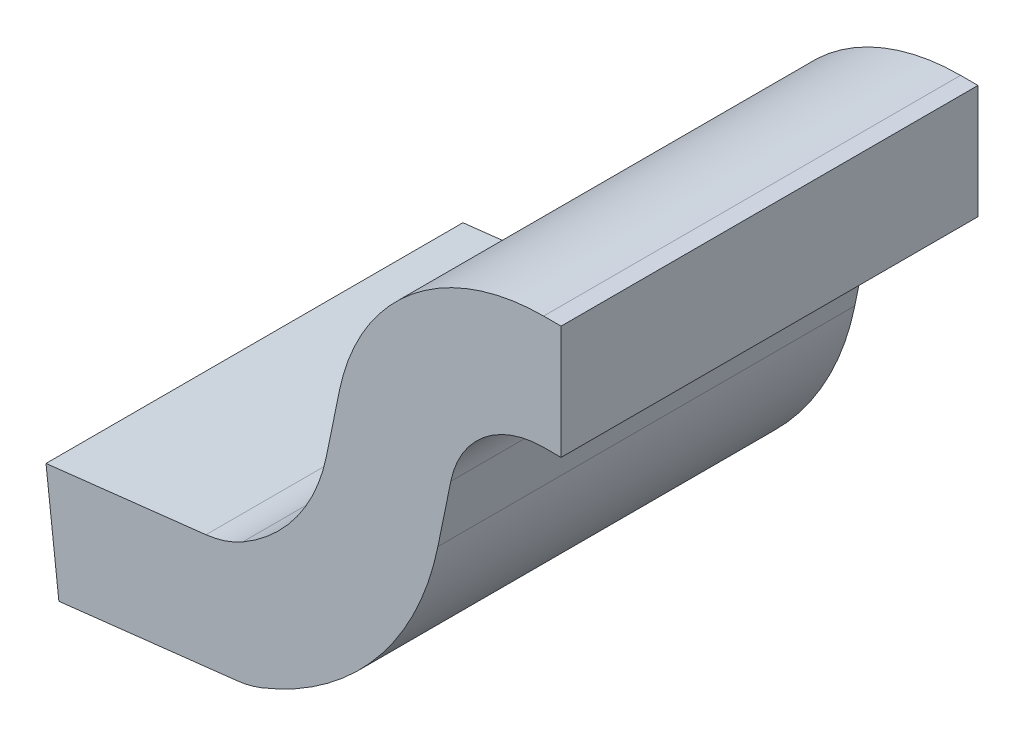
ISO-10303-21;
HEADER;
FILE_DESCRIPTION(('STEP AP214'),'2;1');
FILE_NAME('part.step','',(''),(''),'','','');
FILE_SCHEMA(('AUTOMOTIVE_DESIGN { 1 0 10303 214 1 1 1 1 }'));
ENDSEC;
DATA;
#1=APPLICATION_CONTEXT('core data for automotive mechanical design processes');
#2=APPLICATION_PROTOCOL_DEFINITION('international standard','automotive_design',2000,#1);
#3=PRODUCT_CONTEXT('',#1,'mechanical');
#4=PRODUCT('Part','Part','',(#3));
#5=PRODUCT_RELATED_PRODUCT_CATEGORY('part','',(#4));
#6=PRODUCT_DEFINITION_FORMATION('','',#4);
#7=PRODUCT_DEFINITION_CONTEXT('part definition',#1,'design');
#8=PRODUCT_DEFINITION('design','',#6,#7);
#9=PRODUCT_DEFINITION_SHAPE('','',#8);
#10=(LENGTH_UNIT() NAMED_UNIT(*) SI_UNIT(.MILLI.,.METRE.));
#11=(NAMED_UNIT(*) PLANE_ANGLE_UNIT() SI_UNIT($,.RADIAN.));
#12=(NAMED_UNIT(*) SI_UNIT($,.STERADIAN.) SOLID_ANGLE_UNIT());
#13=UNCERTAINTY_MEASURE_WITH_UNIT(LENGTH_MEASURE(1.E-05),#10,'distance_accuracy_value','');
#14=(GEOMETRIC_REPRESENTATION_CONTEXT(3) GLOBAL_UNCERTAINTY_ASSIGNED_CONTEXT((#13)) GLOBAL_UNIT_ASSIGNED_CONTEXT((#10,
#11,#12)) REPRESENTATION_CONTEXT('',''));
#15=CARTESIAN_POINT('',(0.,0.,0.));
#16=DIRECTION('',(0.,0.,1.));
#17=DIRECTION('',(1.,0.,0.));
#18=AXIS2_PLACEMENT_3D('',#15,#16,#17);
#19=CARTESIAN_POINT('',(-1.0784798395513,0.311122151443951,3.64984430510635));
#20=DIRECTION('',(0.,0.,-1.));
#21=DIRECTION('',(-1.,0.,0.));
#22=AXIS2_PLACEMENT_3D('',#19,#20,#21);
#23=CYLINDRICAL_SURFACE('',#22,0.304673812487565);
#24=CARTESIAN_POINT('',(-1.0784798395513,0.311122151443951,0.28));
#25=DIRECTION('',(0.,0.,1.));
#26=DIRECTION('',(-1.,0.,0.));
#27=AXIS2_PLACEMENT_3D('',#24,#25,#26);
#28=CIRCLE('',#27,0.304673812487565);
#29=CARTESIAN_POINT('',(-0.966363747755729,0.027827050928262,0.28));
#30=VERTEX_POINT('',#29);
#31=CARTESIAN_POINT('',(-0.78,0.25,0.28));
#32=VERTEX_POINT('',#31);
#33=EDGE_CURVE('E11',#30,#32,#28,.T.);
#34=ORIENTED_EDGE('',*,*,#33,.T.);
#35=DIRECTION('',(0.,0.,1.));
#36=VECTOR('',#35,1.);
#37=CARTESIAN_POINT('',(-0.78,0.25,3.64984430510635));
#38=LINE('',#37,#36);
#39=CARTESIAN_POINT('',(-0.78,0.25,0.72));
#40=VERTEX_POINT('',#39);
#41=EDGE_CURVE('E26',#32,#40,#38,.T.);
#42=ORIENTED_EDGE('',*,*,#41,.T.);
#43=CARTESIAN_POINT('',(-1.0784798395513,0.311122151443951,0.72));
#44=DIRECTION('',(0.,0.,-1.));
#45=DIRECTION('',(-1.,0.,0.));
#46=AXIS2_PLACEMENT_3D('',#43,#44,#45);
#47=CIRCLE('',#46,0.304673812487565);
#48=CARTESIAN_POINT('',(-0.966363747755729,0.027827050928262,0.72));
#49=VERTEX_POINT('',#48);
#50=EDGE_CURVE('E246',#40,#49,#47,.T.);
#51=ORIENTED_EDGE('',*,*,#50,.T.);
#52=DIRECTION('',(0.,0.,-1.));
#53=VECTOR('',#52,1.);
#54=CARTESIAN_POINT('',(-0.966363747755728,0.0278270509282621,3.64984430510635));
#55=LINE('',#54,#53);
#56=EDGE_CURVE('E243',#49,#30,#55,.T.);
#57=ORIENTED_EDGE('',*,*,#56,.T.);
#58=EDGE_LOOP('',(#34,#42,#51,#57));
#59=FACE_BOUND('',#58,.T.);
#60=ADVANCED_FACE('F16',(#59),#23,.T.);
#61=CARTESIAN_POINT('',(-0.766369657725016,0.316561504776176,3.64984430510635));
#62=DIRECTION('',(-0.979670149903295,0.200615047761767,0.));
#63=DIRECTION('',(0.143305470647058,0.699808381659803,0.699808381659803));
#64=AXIS2_PLACEMENT_3D('',#61,#62,#63);
#65=PLANE('',#64);
#66=ORIENTED_EDGE('',*,*,#41,.F.);
#67=DIRECTION('',(-0.200615047761767,-0.979670149903295,0.));
#68=VECTOR('',#67,1.);
#69=CARTESIAN_POINT('',(-0.766369657725016,0.316561504776176,0.28));
#70=LINE('',#69,#68);
#71=CARTESIAN_POINT('',(-0.766369657725015,0.316561504776176,0.28));
#72=VERTEX_POINT('',#71);
#73=EDGE_CURVE('E183',#72,#32,#70,.T.);
#74=ORIENTED_EDGE('',*,*,#73,.F.);
#75=DIRECTION('',(0.,0.,-1.));
#76=VECTOR('',#75,1.);
#77=CARTESIAN_POINT('',(-0.766369657725016,0.316561504776176,3.64984430510635));
#78=LINE('',#77,#76);
#79=CARTESIAN_POINT('',(-0.766369657725015,0.316561504776176,0.72));
#80=VERTEX_POINT('',#79);
#81=EDGE_CURVE('E218',#80,#72,#78,.T.);
#82=ORIENTED_EDGE('',*,*,#81,.F.);
#83=DIRECTION('',(0.200615047761767,0.979670149903295,0.));
#84=VECTOR('',#83,1.);
#85=CARTESIAN_POINT('',(-0.766369657725016,0.316561504776176,0.72));
#86=LINE('',#85,#84);
#87=EDGE_CURVE('E128',#40,#80,#86,.T.);
#88=ORIENTED_EDGE('',*,*,#87,.F.);
#89=EDGE_LOOP('',(#66,#74,#82,#88));
#90=FACE_BOUND('',#89,.T.);
#91=ADVANCED_FACE('F251',(#90),#65,.F.);
#92=CARTESIAN_POINT('',(-2.74150408033977,0.,0.28));
#93=DIRECTION('',(0.,0.,-1.));
#94=DIRECTION('',(0.707106781186548,0.707106781186548,0.));
#95=AXIS2_PLACEMENT_3D('',#92,#93,#94);
#96=PLANE('',#95);
#97=DIRECTION('',(0.200615047761764,0.979670149903295,0.));
#98=VECTOR('',#97,1.);
#99=CARTESIAN_POINT('',(-0.897560417988396,0.274073805731411,0.28));
#100=LINE('',#99,#98);
#101=CARTESIAN_POINT('',(-0.897560417988396,0.274073805731411,0.28));
#102=VERTEX_POINT('',#101);
#103=CARTESIAN_POINT('',(-0.883930075713411,0.340635310507587,0.28));
#104=VERTEX_POINT('',#103);
#105=EDGE_CURVE('E175',#102,#104,#100,.T.);
#106=ORIENTED_EDGE('',*,*,#105,.T.);
#107=CARTESIAN_POINT('',(-0.668402642734686,0.2965,0.28));
#108=DIRECTION('',(0.,0.,-1.));
#109=DIRECTION('',(-1.,0.,0.));
#110=AXIS2_PLACEMENT_3D('',#107,#108,#109);
#111=CIRCLE('',#110,0.22);
#112=CARTESIAN_POINT('',(-0.668402642734686,0.5165,0.28));
#113=VERTEX_POINT('',#112);
#114=EDGE_CURVE('E172',#104,#113,#111,.T.);
#115=ORIENTED_EDGE('',*,*,#114,.T.);
#116=DIRECTION('',(1.,0.,0.));
#117=VECTOR('',#116,1.);
#118=CARTESIAN_POINT('',(-2.74150408033977,0.5165,0.28));
#119=LINE('',#118,#117);
#120=CARTESIAN_POINT('',(-0.65,0.5165,0.28));
#121=VERTEX_POINT('',#120);
#122=EDGE_CURVE('E157',#113,#121,#119,.T.);
#123=ORIENTED_EDGE('',*,*,#122,.T.);
#124=DIRECTION('',(0.,-1.,0.));
#125=VECTOR('',#124,1.);
#126=CARTESIAN_POINT('',(-0.65,0.,0.28));
#127=LINE('',#126,#125);
#128=CARTESIAN_POINT('',(-0.65,0.3965,0.28));
#129=VERTEX_POINT('',#128);
#130=EDGE_CURVE('E165',#121,#129,#127,.T.);
#131=ORIENTED_EDGE('',*,*,#130,.T.);
#132=DIRECTION('',(-1.,0.,0.));
#133=VECTOR('',#132,1.);
#134=CARTESIAN_POINT('',(-2.74150408033977,0.3965,0.28));
#135=LINE('',#134,#133);
#136=CARTESIAN_POINT('',(-0.668402642734686,0.3965,0.28));
#137=VERTEX_POINT('',#136);
#138=EDGE_CURVE('E168',#129,#137,#135,.T.);
#139=ORIENTED_EDGE('',*,*,#138,.T.);
#140=CARTESIAN_POINT('',(-0.668402642734686,0.2965,0.28));
#141=DIRECTION('',(0.,0.,1.));
#142=DIRECTION('',(-1.,0.,0.));
#143=AXIS2_PLACEMENT_3D('',#140,#141,#142);
#144=CIRCLE('',#143,0.1);
#145=EDGE_CURVE('E180',#137,#72,#144,.T.);
#146=ORIENTED_EDGE('',*,*,#145,.T.);
#147=ORIENTED_EDGE('',*,*,#73,.T.);
#148=ORIENTED_EDGE('',*,*,#33,.F.);
#149=CARTESIAN_POINT('',(-1.00316247715101,0.120810132802833,0.28));
#150=DIRECTION('',(0.,0.,-1.));
#151=DIRECTION('',(-1.,0.,0.));
#152=AXIS2_PLACEMENT_3D('',#149,#150,#151);
#153=CIRCLE('',#152,0.1);
#154=CARTESIAN_POINT('',(-0.991834300901524,0.0214538424993968,0.28));
#155=VERTEX_POINT('',#154);
#156=EDGE_CURVE('E184',#30,#155,#153,.T.);
#157=ORIENTED_EDGE('',*,*,#156,.T.);
#158=DIRECTION('',(-0.993562903034362,-0.113281762494813,0.));
#159=VECTOR('',#158,1.);
#160=CARTESIAN_POINT('',(-0.991834300901524,0.0214538424993968,0.28));
#161=LINE('',#160,#159);
#162=CARTESIAN_POINT('',(-1.18,0.,0.28));
#163=VERTEX_POINT('',#162);
#164=EDGE_CURVE('E187',#155,#163,#161,.T.);
#165=ORIENTED_EDGE('',*,*,#164,.T.);
#166=DIRECTION('',(-0.113281762494815,0.993562903034362,0.));
#167=VECTOR('',#166,1.);
#168=CARTESIAN_POINT('',(-1.18,0.,0.28));
#169=LINE('',#168,#167);
#170=CARTESIAN_POINT('',(-1.19359381149938,0.119227548364122,0.28));
#171=VERTEX_POINT('',#170);
#172=EDGE_CURVE('E138',#163,#171,#169,.T.);
#173=ORIENTED_EDGE('',*,*,#172,.T.);
#174=DIRECTION('',(0.993562903034362,0.113281762494813,0.));
#175=VECTOR('',#174,1.);
#176=CARTESIAN_POINT('',(-1.19359381149938,0.119227548364122,0.28));
#177=LINE('',#176,#175);
#178=CARTESIAN_POINT('',(-1.02473971532561,0.13847956508155,0.28));
#179=VERTEX_POINT('',#178);
#180=EDGE_CURVE('E190',#171,#179,#177,.T.);
#181=ORIENTED_EDGE('',*,*,#180,.T.);
#182=CARTESIAN_POINT('',(-1.03606789157509,0.237835855384986,0.28));
#183=DIRECTION('',(0.,0.,1.));
#184=DIRECTION('',(-1.,0.,0.));
#185=AXIS2_PLACEMENT_3D('',#182,#183,#184);
#186=CIRCLE('',#185,0.1);
#187=CARTESIAN_POINT('',(-0.985979267087511,0.151284542876496,0.28));
#188=VERTEX_POINT('',#187);
#189=EDGE_CURVE('E193',#179,#188,#186,.T.);
#190=ORIENTED_EDGE('',*,*,#189,.T.);
#191=CARTESIAN_POINT('',(-1.0784798395513,0.311122151443951,0.28));
#192=DIRECTION('',(0.,0.,1.));
#193=DIRECTION('',(-1.,0.,0.));
#194=AXIS2_PLACEMENT_3D('',#191,#192,#193);
#195=CIRCLE('',#194,0.184673812487564);
#196=EDGE_CURVE('E196',#188,#102,#195,.T.);
#197=ORIENTED_EDGE('',*,*,#196,.T.);
#198=EDGE_LOOP('',(#106,#115,#123,#131,#139,#146,#147,#148,#157,#165,#173,#181,#190,#197));
#199=FACE_BOUND('',#198,.T.);
#200=ADVANCED_FACE('F171',(#199),#96,.T.);
#201=CARTESIAN_POINT('',(-1.00316247715101,0.120810132802833,3.64984430510635));
#202=DIRECTION('',(0.,0.,-1.));
#203=DIRECTION('',(-1.,0.,0.));
#204=AXIS2_PLACEMENT_3D('',#201,#202,#203);
#205=CYLINDRICAL_SURFACE('',#204,0.1);
#206=ORIENTED_EDGE('',*,*,#156,.F.);
#207=ORIENTED_EDGE('',*,*,#56,.F.);
#208=CARTESIAN_POINT('',(-1.00316247715101,0.120810132802833,0.72));
#209=DIRECTION('',(0.,0.,-1.));
#210=DIRECTION('',(-1.,0.,0.));
#211=AXIS2_PLACEMENT_3D('',#208,#209,#210);
#212=CIRCLE('',#211,0.1);
#213=CARTESIAN_POINT('',(-0.991834300901524,0.0214538424993968,0.72));
#214=VERTEX_POINT('',#213);
#215=EDGE_CURVE('E198',#49,#214,#212,.T.);
#216=ORIENTED_EDGE('',*,*,#215,.T.);
#217=DIRECTION('',(0.,0.,-1.));
#218=VECTOR('',#217,1.);
#219=CARTESIAN_POINT('',(-0.991834300901524,0.0214538424993968,3.64984430510635));
#220=LINE('',#219,#218);
#221=EDGE_CURVE('E124',#214,#155,#220,.T.);
#222=ORIENTED_EDGE('',*,*,#221,.T.);
#223=EDGE_LOOP('',(#206,#207,#216,#222));
#224=FACE_BOUND('',#223,.T.);
#225=ADVANCED_FACE('F241',(#224),#205,.T.);
#226=CARTESIAN_POINT('',(-2.74150408033977,0.,0.72));
#227=DIRECTION('',(0.,0.,1.));
#228=DIRECTION('',(0.707106781186548,0.707106781186548,0.));
#229=AXIS2_PLACEMENT_3D('',#226,#227,#228);
#230=PLANE('',#229);
#231=DIRECTION('',(1.,0.,0.));
#232=VECTOR('',#231,1.);
#233=CARTESIAN_POINT('',(-2.74150408033977,0.3965,0.72));
#234=LINE('',#233,#232);
#235=CARTESIAN_POINT('',(-0.668402642734686,0.3965,0.72));
#236=VERTEX_POINT('',#235);
#237=CARTESIAN_POINT('',(-0.65,0.3965,0.72));
#238=VERTEX_POINT('',#237);
#239=EDGE_CURVE('E201',#236,#238,#234,.T.);
#240=ORIENTED_EDGE('',*,*,#239,.T.);
#241=DIRECTION('',(0.,1.,0.));
#242=VECTOR('',#241,1.);
#243=CARTESIAN_POINT('',(-0.65,0.,0.72));
#244=LINE('',#243,#242);
#245=CARTESIAN_POINT('',(-0.65,0.5165,0.72));
#246=VERTEX_POINT('',#245);
#247=EDGE_CURVE('E163',#238,#246,#244,.T.);
#248=ORIENTED_EDGE('',*,*,#247,.T.);
#249=DIRECTION('',(-1.,0.,0.));
#250=VECTOR('',#249,1.);
#251=CARTESIAN_POINT('',(-2.74150408033977,0.5165,0.72));
#252=LINE('',#251,#250);
#253=CARTESIAN_POINT('',(-0.668402642734686,0.5165,0.72));
#254=VERTEX_POINT('',#253);
#255=EDGE_CURVE('E160',#246,#254,#252,.T.);
#256=ORIENTED_EDGE('',*,*,#255,.T.);
#257=CARTESIAN_POINT('',(-0.668402642734686,0.2965,0.72));
#258=DIRECTION('',(0.,0.,1.));
#259=DIRECTION('',(-1.,0.,0.));
#260=AXIS2_PLACEMENT_3D('',#257,#258,#259);
#261=CIRCLE('',#260,0.22);
#262=CARTESIAN_POINT('',(-0.883930075713411,0.340635310507587,0.72));
#263=VERTEX_POINT('',#262);
#264=EDGE_CURVE('E205',#254,#263,#261,.T.);
#265=ORIENTED_EDGE('',*,*,#264,.T.);
#266=DIRECTION('',(-0.200615047761764,-0.979670149903295,0.));
#267=VECTOR('',#266,1.);
#268=CARTESIAN_POINT('',(-0.883930075713411,0.340635310507586,0.72));
#269=LINE('',#268,#267);
#270=CARTESIAN_POINT('',(-0.897560417988396,0.274073805731411,0.72));
#271=VERTEX_POINT('',#270);
#272=EDGE_CURVE('E208',#263,#271,#269,.T.);
#273=ORIENTED_EDGE('',*,*,#272,.T.);
#274=CARTESIAN_POINT('',(-1.0784798395513,0.311122151443951,0.72));
#275=DIRECTION('',(0.,0.,-1.));
#276=DIRECTION('',(-1.,0.,0.));
#277=AXIS2_PLACEMENT_3D('',#274,#275,#276);
#278=CIRCLE('',#277,0.184673812487564);
#279=CARTESIAN_POINT('',(-0.985979267087511,0.151284542876496,0.72));
#280=VERTEX_POINT('',#279);
#281=EDGE_CURVE('E211',#271,#280,#278,.T.);
#282=ORIENTED_EDGE('',*,*,#281,.T.);
#283=CARTESIAN_POINT('',(-1.03606789157509,0.237835855384986,0.72));
#284=DIRECTION('',(0.,0.,-1.));
#285=DIRECTION('',(-1.,0.,0.));
#286=AXIS2_PLACEMENT_3D('',#283,#284,#285);
#287=CIRCLE('',#286,0.1);
#288=CARTESIAN_POINT('',(-1.02473971532561,0.13847956508155,0.72));
#289=VERTEX_POINT('',#288);
#290=EDGE_CURVE('E214',#280,#289,#287,.T.);
#291=ORIENTED_EDGE('',*,*,#290,.T.);
#292=DIRECTION('',(-0.993562903034362,-0.113281762494813,0.));
#293=VECTOR('',#292,1.);
#294=CARTESIAN_POINT('',(-1.02473971532561,0.13847956508155,0.72));
#295=LINE('',#294,#293);
#296=CARTESIAN_POINT('',(-1.19359381149938,0.119227548364122,0.72));
#297=VERTEX_POINT('',#296);
#298=EDGE_CURVE('E133',#289,#297,#295,.T.);
#299=ORIENTED_EDGE('',*,*,#298,.T.);
#300=DIRECTION('',(0.113281762494815,-0.993562903034362,0.));
#301=VECTOR('',#300,1.);
#302=CARTESIAN_POINT('',(-1.19359381149938,0.119227548364122,0.72));
#303=LINE('',#302,#301);
#304=CARTESIAN_POINT('',(-1.18,0.,0.72));
#305=VERTEX_POINT('',#304);
#306=EDGE_CURVE('E114',#297,#305,#303,.T.);
#307=ORIENTED_EDGE('',*,*,#306,.T.);
#308=DIRECTION('',(0.993562903034362,0.113281762494813,0.));
#309=VECTOR('',#308,1.);
#310=CARTESIAN_POINT('',(-1.18,0.,0.72));
#311=LINE('',#310,#309);
#312=EDGE_CURVE('E120',#305,#214,#311,.T.);
#313=ORIENTED_EDGE('',*,*,#312,.T.);
#314=ORIENTED_EDGE('',*,*,#215,.F.);
#315=ORIENTED_EDGE('',*,*,#50,.F.);
#316=ORIENTED_EDGE('',*,*,#87,.T.);
#317=CARTESIAN_POINT('',(-0.668402642734686,0.2965,0.72));
#318=DIRECTION('',(0.,0.,-1.));
#319=DIRECTION('',(-1.,0.,0.));
#320=AXIS2_PLACEMENT_3D('',#317,#318,#319);
#321=CIRCLE('',#320,0.1);
#322=EDGE_CURVE('E217',#80,#236,#321,.T.);
#323=ORIENTED_EDGE('',*,*,#322,.T.);
#324=EDGE_LOOP('',(#240,#248,#256,#265,#273,#282,#291,#299,#307,#313,#314,#315,#316,#323));
#325=FACE_BOUND('',#324,.T.);
#326=ADVANCED_FACE('F131',(#325),#230,.T.);
#327=CARTESIAN_POINT('',(-0.668402642734686,0.2965,3.64984430510635));
#328=DIRECTION('',(0.,0.,-1.));
#329=DIRECTION('',(-1.,0.,0.));
#330=AXIS2_PLACEMENT_3D('',#327,#328,#329);
#331=CYLINDRICAL_SURFACE('',#330,0.1);
#332=ORIENTED_EDGE('',*,*,#81,.T.);
#333=ORIENTED_EDGE('',*,*,#145,.F.);
#334=DIRECTION('',(0.,0.,-1.));
#335=VECTOR('',#334,1.);
#336=CARTESIAN_POINT('',(-0.668402642734686,0.3965,3.64984430510635));
#337=LINE('',#336,#335);
#338=EDGE_CURVE('E141',#236,#137,#337,.T.);
#339=ORIENTED_EDGE('',*,*,#338,.F.);
#340=ORIENTED_EDGE('',*,*,#322,.F.);
#341=EDGE_LOOP('',(#332,#333,#339,#340));
#342=FACE_BOUND('',#341,.T.);
#343=ADVANCED_FACE('F260',(#342),#331,.F.);
#344=CARTESIAN_POINT('',(-0.668402642734686,0.2965,3.64984430510635));
#345=DIRECTION('',(0.,0.,-1.));
#346=DIRECTION('',(-1.,0.,0.));
#347=AXIS2_PLACEMENT_3D('',#344,#345,#346);
#348=CYLINDRICAL_SURFACE('',#347,0.22);
#349=ORIENTED_EDGE('',*,*,#114,.F.);
#350=DIRECTION('',(0.,0.,1.));
#351=VECTOR('',#350,1.);
#352=CARTESIAN_POINT('',(-0.883930075713411,0.340635310507586,3.64984430510635));
#353=LINE('',#352,#351);
#354=EDGE_CURVE('E220',#104,#263,#353,.T.);
#355=ORIENTED_EDGE('',*,*,#354,.T.);
#356=ORIENTED_EDGE('',*,*,#264,.F.);
#357=DIRECTION('',(0.,0.,-1.));
#358=VECTOR('',#357,1.);
#359=CARTESIAN_POINT('',(-0.668402642734686,0.5165,3.64984430510635));
#360=LINE('',#359,#358);
#361=EDGE_CURVE('E223',#254,#113,#360,.T.);
#362=ORIENTED_EDGE('',*,*,#361,.T.);
#363=EDGE_LOOP('',(#349,#355,#356,#362));
#364=FACE_BOUND('',#363,.T.);
#365=ADVANCED_FACE('F287',(#364),#348,.T.);
#366=CARTESIAN_POINT('',(-0.883930075713411,0.340635310507586,3.64984430510635));
#367=DIRECTION('',(0.979670149903295,-0.200615047761764,0.));
#368=DIRECTION('',(0.143305470647057,0.699808381659803,0.699808381659803));
#369=AXIS2_PLACEMENT_3D('',#366,#367,#368);
#370=PLANE('',#369);
#371=ORIENTED_EDGE('',*,*,#354,.F.);
#372=ORIENTED_EDGE('',*,*,#105,.F.);
#373=DIRECTION('',(0.,0.,-1.));
#374=VECTOR('',#373,1.);
#375=CARTESIAN_POINT('',(-0.897560417988396,0.274073805731411,3.64984430510635));
#376=LINE('',#375,#374);
#377=EDGE_CURVE('E225',#271,#102,#376,.T.);
#378=ORIENTED_EDGE('',*,*,#377,.F.);
#379=ORIENTED_EDGE('',*,*,#272,.F.);
#380=EDGE_LOOP('',(#371,#372,#378,#379));
#381=FACE_BOUND('',#380,.T.);
#382=ADVANCED_FACE('F290',(#381),#370,.F.);
#383=CARTESIAN_POINT('',(-1.0784798395513,0.311122151443951,3.64984430510635));
#384=DIRECTION('',(0.,0.,-1.));
#385=DIRECTION('',(-1.,0.,0.));
#386=AXIS2_PLACEMENT_3D('',#383,#384,#385);
#387=CYLINDRICAL_SURFACE('',#386,0.184673812487564);
#388=ORIENTED_EDGE('',*,*,#377,.T.);
#389=ORIENTED_EDGE('',*,*,#196,.F.);
#390=DIRECTION('',(0.,0.,-1.));
#391=VECTOR('',#390,1.);
#392=CARTESIAN_POINT('',(-0.985979267087511,0.151284542876496,3.64984430510635));
#393=LINE('',#392,#391);
#394=EDGE_CURVE('E228',#280,#188,#393,.T.);
#395=ORIENTED_EDGE('',*,*,#394,.F.);
#396=ORIENTED_EDGE('',*,*,#281,.F.);
#397=EDGE_LOOP('',(#388,#389,#395,#396));
#398=FACE_BOUND('',#397,.T.);
#399=ADVANCED_FACE('F294',(#398),#387,.F.);
#400=CARTESIAN_POINT('',(-1.03606789157509,0.237835855384986,3.64984430510635));
#401=DIRECTION('',(0.,0.,-1.));
#402=DIRECTION('',(-1.,0.,0.));
#403=AXIS2_PLACEMENT_3D('',#400,#401,#402);
#404=CYLINDRICAL_SURFACE('',#403,0.1);
#405=ORIENTED_EDGE('',*,*,#394,.T.);
#406=ORIENTED_EDGE('',*,*,#189,.F.);
#407=DIRECTION('',(0.,0.,-1.));
#408=VECTOR('',#407,1.);
#409=CARTESIAN_POINT('',(-1.02473971532561,0.13847956508155,3.64984430510635));
#410=LINE('',#409,#408);
#411=EDGE_CURVE('E143',#289,#179,#410,.T.);
#412=ORIENTED_EDGE('',*,*,#411,.F.);
#413=ORIENTED_EDGE('',*,*,#290,.F.);
#414=EDGE_LOOP('',(#405,#406,#412,#413));
#415=FACE_BOUND('',#414,.T.);
#416=ADVANCED_FACE('F235',(#415),#404,.F.);
#417=CARTESIAN_POINT('',(-1.19359381149938,0.119227548364122,3.64984430510635));
#418=DIRECTION('',(0.113281762494814,-0.993562903034362,0.));
#419=DIRECTION('',(0.704819900881673,0.0803605291315253,0.704819900881673));
#420=AXIS2_PLACEMENT_3D('',#417,#418,#419);
#421=PLANE('',#420);
#422=ORIENTED_EDGE('',*,*,#411,.T.);
#423=ORIENTED_EDGE('',*,*,#180,.F.);
#424=DIRECTION('',(0.,0.,-1.));
#425=VECTOR('',#424,1.);
#426=CARTESIAN_POINT('',(-1.19359381149938,0.119227548364122,3.64984430510635));
#427=LINE('',#426,#425);
#428=EDGE_CURVE('E140',#297,#171,#427,.T.);
#429=ORIENTED_EDGE('',*,*,#428,.F.);
#430=ORIENTED_EDGE('',*,*,#298,.F.);
#431=EDGE_LOOP('',(#422,#423,#429,#430));
#432=FACE_BOUND('',#431,.T.);
#433=ADVANCED_FACE('F233',(#432),#421,.F.);
#434=CARTESIAN_POINT('',(-1.19359381149938,0.119227548364122,3.64984430510635));
#435=DIRECTION('',(0.993562903034361,0.11328176249482,0.));
#436=DIRECTION('',(-0.0803605291315301,0.704819900881672,0.704819900881672));
#437=AXIS2_PLACEMENT_3D('',#434,#435,#436);
#438=PLANE('',#437);
#439=ORIENTED_EDGE('',*,*,#428,.T.);
#440=ORIENTED_EDGE('',*,*,#172,.F.);
#441=DIRECTION('',(0.,0.,-1.));
#442=VECTOR('',#441,1.);
#443=CARTESIAN_POINT('',(-1.18,0.,3.64984430510635));
#444=LINE('',#443,#442);
#445=EDGE_CURVE('E122',#305,#163,#444,.T.);
#446=ORIENTED_EDGE('',*,*,#445,.F.);
#447=ORIENTED_EDGE('',*,*,#306,.F.);
#448=EDGE_LOOP('',(#439,#440,#446,#447));
#449=FACE_BOUND('',#448,.T.);
#450=ADVANCED_FACE('F136',(#449),#438,.F.);
#451=CARTESIAN_POINT('',(-1.18,0.,3.64984430510635));
#452=DIRECTION('',(-0.113281762494813,0.993562903034362,0.));
#453=DIRECTION('',(0.704819900881673,0.0803605291315249,0.704819900881673));
#454=AXIS2_PLACEMENT_3D('',#451,#452,#453);
#455=PLANE('',#454);
#456=ORIENTED_EDGE('',*,*,#445,.T.);
#457=ORIENTED_EDGE('',*,*,#164,.F.);
#458=ORIENTED_EDGE('',*,*,#221,.F.);
#459=ORIENTED_EDGE('',*,*,#312,.F.);
#460=EDGE_LOOP('',(#456,#457,#458,#459));
#461=FACE_BOUND('',#460,.T.);
#462=ADVANCED_FACE('F121',(#461),#455,.F.);
#463=CARTESIAN_POINT('',(-0.65,0.3965,3.64984430510635));
#464=DIRECTION('',(0.,1.,0.));
#465=DIRECTION('',(0.707106781186548,0.,0.707106781186548));
#466=AXIS2_PLACEMENT_3D('',#463,#464,#465);
#467=PLANE('',#466);
#468=ORIENTED_EDGE('',*,*,#338,.T.);
#469=ORIENTED_EDGE('',*,*,#138,.F.);
#470=DIRECTION('',(0.,0.,-1.));
#471=VECTOR('',#470,1.);
#472=CARTESIAN_POINT('',(-0.65,0.3965,3.64984430510635));
#473=LINE('',#472,#471);
#474=EDGE_CURVE('E146',#238,#129,#473,.T.);
#475=ORIENTED_EDGE('',*,*,#474,.F.);
#476=ORIENTED_EDGE('',*,*,#239,.F.);
#477=EDGE_LOOP('',(#468,#469,#475,#476));
#478=FACE_BOUND('',#477,.T.);
#479=ADVANCED_FACE('F263',(#478),#467,.F.);
#480=CARTESIAN_POINT('',(-0.65,0.5165,3.64984430510635));
#481=DIRECTION('',(-1.,0.,0.));
#482=DIRECTION('',(0.,0.707106781186548,0.707106781186548));
#483=AXIS2_PLACEMENT_3D('',#480,#481,#482);
#484=PLANE('',#483);
#485=ORIENTED_EDGE('',*,*,#474,.T.);
#486=ORIENTED_EDGE('',*,*,#130,.F.);
#487=DIRECTION('',(0.,0.,-1.));
#488=VECTOR('',#487,1.);
#489=CARTESIAN_POINT('',(-0.65,0.5165,3.64984430510635));
#490=LINE('',#489,#488);
#491=EDGE_CURVE('E20',#246,#121,#490,.T.);
#492=ORIENTED_EDGE('',*,*,#491,.F.);
#493=ORIENTED_EDGE('',*,*,#247,.F.);
#494=EDGE_LOOP('',(#485,#486,#492,#493));
#495=FACE_BOUND('',#494,.T.);
#496=ADVANCED_FACE('F162',(#495),#484,.F.);
#497=CARTESIAN_POINT('',(-0.65,0.5165,3.64984430510635));
#498=DIRECTION('',(0.,-1.,0.));
#499=DIRECTION('',(0.707106781186548,0.,0.707106781186548));
#500=AXIS2_PLACEMENT_3D('',#497,#498,#499);
#501=PLANE('',#500);
#502=ORIENTED_EDGE('',*,*,#491,.T.);
#503=ORIENTED_EDGE('',*,*,#122,.F.);
#504=ORIENTED_EDGE('',*,*,#361,.F.);
#505=ORIENTED_EDGE('',*,*,#255,.F.);
#506=EDGE_LOOP('',(#502,#503,#504,#505));
#507=FACE_BOUND('',#506,.T.);
#508=ADVANCED_FACE('F18',(#507),#501,.F.);
#509=CLOSED_SHELL('',(#60,#91,#200,#225,#326,#343,#365,#382,#399,#416,#433,#450,#462,#479,#496,#508));
#510=MANIFOLD_SOLID_BREP('B1',#509);
#511=ADVANCED_BREP_SHAPE_REPRESENTATION('',(#18,#510),#14);
#512=SHAPE_DEFINITION_REPRESENTATION(#9,#511);
ENDSEC;
END-ISO-10303-21;
